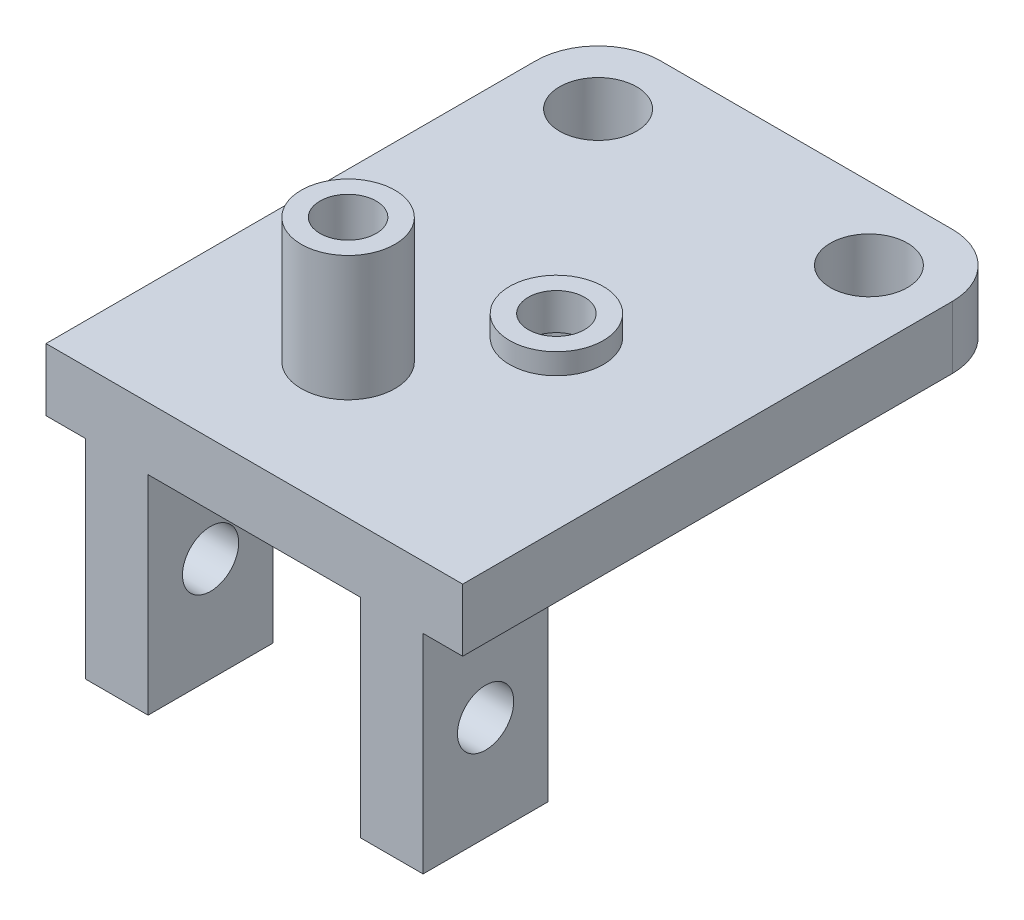
ISO-10303-21;
HEADER;
FILE_DESCRIPTION(('STEP AP214'),'2;1');
FILE_NAME('part.step','',(''),(''),'','','');
FILE_SCHEMA(('AUTOMOTIVE_DESIGN { 1 0 10303 214 1 1 1 1 }'));
ENDSEC;
DATA;
#1=APPLICATION_CONTEXT('core data for automotive mechanical design processes');
#2=APPLICATION_PROTOCOL_DEFINITION('international standard','automotive_design',2000,#1);
#3=PRODUCT_CONTEXT('',#1,'mechanical');
#4=PRODUCT('Part','Part','',(#3));
#5=PRODUCT_RELATED_PRODUCT_CATEGORY('part','',(#4));
#6=PRODUCT_DEFINITION_FORMATION('','',#4);
#7=PRODUCT_DEFINITION_CONTEXT('part definition',#1,'design');
#8=PRODUCT_DEFINITION('design','',#6,#7);
#9=PRODUCT_DEFINITION_SHAPE('','',#8);
#10=(LENGTH_UNIT() NAMED_UNIT(*) SI_UNIT(.MILLI.,.METRE.));
#11=(NAMED_UNIT(*) PLANE_ANGLE_UNIT() SI_UNIT($,.RADIAN.));
#12=(NAMED_UNIT(*) SI_UNIT($,.STERADIAN.) SOLID_ANGLE_UNIT());
#13=UNCERTAINTY_MEASURE_WITH_UNIT(LENGTH_MEASURE(1.E-05),#10,'distance_accuracy_value','');
#14=(GEOMETRIC_REPRESENTATION_CONTEXT(3) GLOBAL_UNCERTAINTY_ASSIGNED_CONTEXT((#13)) GLOBAL_UNIT_ASSIGNED_CONTEXT((#10,
#11,#12)) REPRESENTATION_CONTEXT('',''));
#15=CARTESIAN_POINT('',(0.,0.,0.));
#16=DIRECTION('',(0.,0.,1.));
#17=DIRECTION('',(1.,0.,0.));
#18=AXIS2_PLACEMENT_3D('',#15,#16,#17);
#19=CARTESIAN_POINT('',(0.,0.,0.));
#20=DIRECTION('',(1.,0.,0.));
#21=DIRECTION('',(0.,0.,-1.));
#22=AXIS2_PLACEMENT_3D('',#19,#20,#21);
#23=PLANE('',#22);
#24=DIRECTION('',(0.,0.,1.));
#25=VECTOR('',#24,1.);
#26=CARTESIAN_POINT('',(0.,0.,0.));
#27=LINE('',#26,#25);
#28=CARTESIAN_POINT('',(0.,0.,-47.));
#29=VERTEX_POINT('',#28);
#30=CARTESIAN_POINT('',(0.,0.,0.));
#31=VERTEX_POINT('',#30);
#32=EDGE_CURVE('E245',#29,#31,#27,.T.);
#33=ORIENTED_EDGE('',*,*,#32,.F.);
#34=DIRECTION('',(0.,-1.,0.));
#35=VECTOR('',#34,1.);
#36=CARTESIAN_POINT('',(0.,0.,-47.));
#37=LINE('',#36,#35);
#38=CARTESIAN_POINT('',(0.,6.,-47.));
#39=VERTEX_POINT('',#38);
#40=EDGE_CURVE('E234',#39,#29,#37,.T.);
#41=ORIENTED_EDGE('',*,*,#40,.F.);
#42=DIRECTION('',(0.,0.,1.));
#43=VECTOR('',#42,1.);
#44=CARTESIAN_POINT('',(0.,6.,0.));
#45=LINE('',#44,#43);
#46=CARTESIAN_POINT('',(0.,6.,0.));
#47=VERTEX_POINT('',#46);
#48=EDGE_CURVE('E227',#39,#47,#45,.T.);
#49=ORIENTED_EDGE('',*,*,#48,.T.);
#50=DIRECTION('',(0.,-1.,0.));
#51=VECTOR('',#50,1.);
#52=CARTESIAN_POINT('',(0.,6.,0.));
#53=LINE('',#52,#51);
#54=EDGE_CURVE('E236',#47,#31,#53,.T.);
#55=ORIENTED_EDGE('',*,*,#54,.T.);
#56=EDGE_LOOP('',(#33,#41,#49,#55));
#57=FACE_BOUND('',#56,.T.);
#58=ADVANCED_FACE('F40',(#57),#23,.T.);
#59=CARTESIAN_POINT('',(-24.,0.,-13.));
#60=DIRECTION('',(0.,-1.,0.));
#61=DIRECTION('',(0.,0.,-1.));
#62=AXIS2_PLACEMENT_3D('',#59,#60,#61);
#63=CYLINDRICAL_SURFACE('',#62,2.69999999999999);
#64=CARTESIAN_POINT('',(-24.,4.5,-13.));
#65=DIRECTION('',(0.,-1.,0.));
#66=DIRECTION('',(0.,0.,-1.));
#67=AXIS2_PLACEMENT_3D('',#64,#65,#66);
#68=CIRCLE('',#67,2.69999999999999);
#69=CARTESIAN_POINT('',(-24.,4.5,-15.7));
#70=VERTEX_POINT('',#69);
#71=EDGE_CURVE('E363',#70,#70,#68,.T.);
#72=ORIENTED_EDGE('',*,*,#71,.T.);
#73=EDGE_LOOP('',(#72));
#74=FACE_BOUND('',#73,.T.);
#75=CARTESIAN_POINT('',(-24.,18.,-13.));
#76=DIRECTION('',(0.,-1.,0.));
#77=DIRECTION('',(0.,0.,-1.));
#78=AXIS2_PLACEMENT_3D('',#75,#76,#77);
#79=CIRCLE('',#78,2.7);
#80=CARTESIAN_POINT('',(-24.,18.,-15.7));
#81=VERTEX_POINT('',#80);
#82=EDGE_CURVE('E359',#81,#81,#79,.T.);
#83=ORIENTED_EDGE('',*,*,#82,.F.);
#84=EDGE_LOOP('',(#83));
#85=FACE_BOUND('',#84,.T.);
#86=ADVANCED_FACE('F600',(#74,#85),#63,.F.);
#87=CARTESIAN_POINT('',(-16.,0.,-25.));
#88=DIRECTION('',(0.,-1.,0.));
#89=DIRECTION('',(0.,0.,-1.));
#90=AXIS2_PLACEMENT_3D('',#87,#88,#89);
#91=CYLINDRICAL_SURFACE('',#90,2.69999999999999);
#92=CARTESIAN_POINT('',(-16.,8.,-25.));
#93=DIRECTION('',(0.,1.,0.));
#94=DIRECTION('',(0.,0.,1.));
#95=AXIS2_PLACEMENT_3D('',#92,#93,#94);
#96=CIRCLE('',#95,2.69999999999999);
#97=CARTESIAN_POINT('',(-16.,8.,-22.3));
#98=VERTEX_POINT('',#97);
#99=EDGE_CURVE('E355',#98,#98,#96,.T.);
#100=ORIENTED_EDGE('',*,*,#99,.T.);
#101=EDGE_LOOP('',(#100));
#102=FACE_BOUND('',#101,.T.);
#103=CARTESIAN_POINT('',(-16.,4.5,-25.));
#104=DIRECTION('',(0.,-1.,0.));
#105=DIRECTION('',(0.,0.,-1.));
#106=AXIS2_PLACEMENT_3D('',#103,#104,#105);
#107=CIRCLE('',#106,2.69999999999999);
#108=CARTESIAN_POINT('',(-16.,4.5,-27.7));
#109=VERTEX_POINT('',#108);
#110=EDGE_CURVE('E354',#109,#109,#107,.T.);
#111=ORIENTED_EDGE('',*,*,#110,.T.);
#112=EDGE_LOOP('',(#111));
#113=FACE_BOUND('',#112,.T.);
#114=ADVANCED_FACE('F602',(#102,#113),#91,.F.);
#115=CARTESIAN_POINT('',(0.,4.5,0.));
#116=DIRECTION('',(0.,-1.,0.));
#117=DIRECTION('',(0.,0.,-1.));
#118=AXIS2_PLACEMENT_3D('',#115,#116,#117);
#119=PLANE('',#118);
#120=ORIENTED_EDGE('',*,*,#110,.F.);
#121=EDGE_LOOP('',(#120));
#122=FACE_BOUND('',#121,.T.);
#123=DIRECTION('',(0.866025403784439,0.,0.5));
#124=VECTOR('',#123,1.);
#125=CARTESIAN_POINT('',(-20.2,4.5,-22.5751288694036));
#126=LINE('',#125,#124);
#127=CARTESIAN_POINT('',(-20.2,4.5,-22.5751288694036));
#128=VERTEX_POINT('',#127);
#129=CARTESIAN_POINT('',(-16.,4.5,-20.1502577388071));
#130=VERTEX_POINT('',#129);
#131=EDGE_CURVE('E429',#128,#130,#126,.T.);
#132=ORIENTED_EDGE('',*,*,#131,.F.);
#133=DIRECTION('',(0.,0.,1.));
#134=VECTOR('',#133,1.);
#135=CARTESIAN_POINT('',(-20.2,4.5,-27.4248711305964));
#136=LINE('',#135,#134);
#137=CARTESIAN_POINT('',(-20.2,4.5,-27.4248711305964));
#138=VERTEX_POINT('',#137);
#139=EDGE_CURVE('E434',#138,#128,#136,.T.);
#140=ORIENTED_EDGE('',*,*,#139,.F.);
#141=DIRECTION('',(-0.866025403784439,0.,0.5));
#142=VECTOR('',#141,1.);
#143=CARTESIAN_POINT('',(-16.,4.5,-29.8497422611929));
#144=LINE('',#143,#142);
#145=CARTESIAN_POINT('',(-16.,4.5,-29.8497422611929));
#146=VERTEX_POINT('',#145);
#147=EDGE_CURVE('E437',#146,#138,#144,.T.);
#148=ORIENTED_EDGE('',*,*,#147,.F.);
#149=DIRECTION('',(-0.866025403784438,0.,-0.5));
#150=VECTOR('',#149,1.);
#151=CARTESIAN_POINT('',(-11.8,4.5,-27.4248711305964));
#152=LINE('',#151,#150);
#153=CARTESIAN_POINT('',(-11.8,4.5,-27.4248711305964));
#154=VERTEX_POINT('',#153);
#155=EDGE_CURVE('E440',#154,#146,#152,.T.);
#156=ORIENTED_EDGE('',*,*,#155,.F.);
#157=DIRECTION('',(0.,0.,-1.));
#158=VECTOR('',#157,1.);
#159=CARTESIAN_POINT('',(-11.8,4.5,-22.5751288694036));
#160=LINE('',#159,#158);
#161=CARTESIAN_POINT('',(-11.8,4.5,-22.5751288694036));
#162=VERTEX_POINT('',#161);
#163=EDGE_CURVE('E443',#162,#154,#160,.T.);
#164=ORIENTED_EDGE('',*,*,#163,.F.);
#165=DIRECTION('',(0.866025403784439,0.,-0.5));
#166=VECTOR('',#165,1.);
#167=CARTESIAN_POINT('',(-16.,4.5,-20.1502577388071));
#168=LINE('',#167,#166);
#169=EDGE_CURVE('E446',#130,#162,#168,.T.);
#170=ORIENTED_EDGE('',*,*,#169,.F.);
#171=EDGE_LOOP('',(#132,#140,#148,#156,#164,#170));
#172=FACE_BOUND('',#171,.T.);
#173=ADVANCED_FACE('F609',(#122,#172),#119,.T.);
#174=CARTESIAN_POINT('',(0.,4.5,0.));
#175=DIRECTION('',(0.,-1.,0.));
#176=DIRECTION('',(0.,0.,-1.));
#177=AXIS2_PLACEMENT_3D('',#174,#175,#176);
#178=PLANE('',#177);
#179=ORIENTED_EDGE('',*,*,#71,.F.);
#180=EDGE_LOOP('',(#179));
#181=FACE_BOUND('',#180,.T.);
#182=DIRECTION('',(0.,0.,1.));
#183=VECTOR('',#182,1.);
#184=CARTESIAN_POINT('',(-28.2,4.5,-15.4248711305964));
#185=LINE('',#184,#183);
#186=CARTESIAN_POINT('',(-28.2,4.5,-15.4248711305964));
#187=VERTEX_POINT('',#186);
#188=CARTESIAN_POINT('',(-28.2,4.5,-10.5751288694036));
#189=VERTEX_POINT('',#188);
#190=EDGE_CURVE('E364',#187,#189,#185,.T.);
#191=ORIENTED_EDGE('',*,*,#190,.F.);
#192=DIRECTION('',(-0.866025403784439,0.,0.5));
#193=VECTOR('',#192,1.);
#194=CARTESIAN_POINT('',(-24.,4.5,-17.8497422611929));
#195=LINE('',#194,#193);
#196=CARTESIAN_POINT('',(-24.,4.5,-17.8497422611929));
#197=VERTEX_POINT('',#196);
#198=EDGE_CURVE('E369',#197,#187,#195,.T.);
#199=ORIENTED_EDGE('',*,*,#198,.F.);
#200=DIRECTION('',(-0.866025403784438,0.,-0.500000000000001));
#201=VECTOR('',#200,1.);
#202=CARTESIAN_POINT('',(-19.8,4.5,-15.4248711305964));
#203=LINE('',#202,#201);
#204=CARTESIAN_POINT('',(-19.8,4.5,-15.4248711305964));
#205=VERTEX_POINT('',#204);
#206=EDGE_CURVE('E372',#205,#197,#203,.T.);
#207=ORIENTED_EDGE('',*,*,#206,.F.);
#208=DIRECTION('',(0.,0.,-1.));
#209=VECTOR('',#208,1.);
#210=CARTESIAN_POINT('',(-19.8,4.5,-10.5751288694036));
#211=LINE('',#210,#209);
#212=CARTESIAN_POINT('',(-19.8,4.5,-10.5751288694036));
#213=VERTEX_POINT('',#212);
#214=EDGE_CURVE('E375',#213,#205,#211,.T.);
#215=ORIENTED_EDGE('',*,*,#214,.F.);
#216=DIRECTION('',(0.866025403784438,0.,-0.5));
#217=VECTOR('',#216,1.);
#218=CARTESIAN_POINT('',(-24.,4.5,-8.15025773880714));
#219=LINE('',#218,#217);
#220=CARTESIAN_POINT('',(-24.,4.5,-8.15025773880714));
#221=VERTEX_POINT('',#220);
#222=EDGE_CURVE('E378',#221,#213,#219,.T.);
#223=ORIENTED_EDGE('',*,*,#222,.F.);
#224=DIRECTION('',(0.866025403784438,0.,0.500000000000001));
#225=VECTOR('',#224,1.);
#226=CARTESIAN_POINT('',(-28.2,4.5,-10.5751288694036));
#227=LINE('',#226,#225);
#228=EDGE_CURVE('E381',#189,#221,#227,.T.);
#229=ORIENTED_EDGE('',*,*,#228,.F.);
#230=EDGE_LOOP('',(#191,#199,#207,#215,#223,#229));
#231=FACE_BOUND('',#230,.T.);
#232=ADVANCED_FACE('F615',(#181,#231),#178,.T.);
#233=CARTESIAN_POINT('',(-9.8,-10.,-6.));
#234=DIRECTION('',(-1.,0.,0.));
#235=DIRECTION('',(0.,0.,1.));
#236=AXIS2_PLACEMENT_3D('',#233,#234,#235);
#237=CYLINDRICAL_SURFACE('',#236,2.69999999999999);
#238=CARTESIAN_POINT('',(-3.8,-10.,-6.));
#239=DIRECTION('',(1.,0.,0.));
#240=DIRECTION('',(0.,0.,-1.));
#241=AXIS2_PLACEMENT_3D('',#238,#239,#240);
#242=CIRCLE('',#241,2.69999999999999);
#243=CARTESIAN_POINT('',(-3.8,-10.,-8.69999999999999));
#244=VERTEX_POINT('',#243);
#245=EDGE_CURVE('E301',#244,#244,#242,.T.);
#246=ORIENTED_EDGE('',*,*,#245,.T.);
#247=EDGE_LOOP('',(#246));
#248=FACE_BOUND('',#247,.T.);
#249=CARTESIAN_POINT('',(-9.8,-10.,-6.));
#250=DIRECTION('',(-1.,0.,0.));
#251=DIRECTION('',(0.,0.,1.));
#252=AXIS2_PLACEMENT_3D('',#249,#250,#251);
#253=CIRCLE('',#252,2.69999999999999);
#254=CARTESIAN_POINT('',(-9.8,-10.,-3.30000000000001));
#255=VERTEX_POINT('',#254);
#256=EDGE_CURVE('E297',#255,#255,#253,.T.);
#257=ORIENTED_EDGE('',*,*,#256,.T.);
#258=EDGE_LOOP('',(#257));
#259=FACE_BOUND('',#258,.T.);
#260=ADVANCED_FACE('F637',(#248,#259),#237,.F.);
#261=CARTESIAN_POINT('',(-30.2,-10.,-6.));
#262=DIRECTION('',(1.,0.,0.));
#263=DIRECTION('',(0.,0.,-1.));
#264=AXIS2_PLACEMENT_3D('',#261,#262,#263);
#265=CYLINDRICAL_SURFACE('',#264,2.69999999999999);
#266=CARTESIAN_POINT('',(-30.2,-10.,-6.));
#267=DIRECTION('',(1.,0.,0.));
#268=DIRECTION('',(0.,0.,-1.));
#269=AXIS2_PLACEMENT_3D('',#266,#267,#268);
#270=CIRCLE('',#269,2.69999999999999);
#271=CARTESIAN_POINT('',(-30.2,-10.,-8.69999999999999));
#272=VERTEX_POINT('',#271);
#273=EDGE_CURVE('E12',#272,#272,#270,.T.);
#274=ORIENTED_EDGE('',*,*,#273,.T.);
#275=EDGE_LOOP('',(#274));
#276=FACE_BOUND('',#275,.T.);
#277=CARTESIAN_POINT('',(-36.2,-10.,-6.));
#278=DIRECTION('',(1.,0.,0.));
#279=DIRECTION('',(0.,0.,-1.));
#280=AXIS2_PLACEMENT_3D('',#277,#278,#279);
#281=CIRCLE('',#280,2.69999999999999);
#282=CARTESIAN_POINT('',(-36.2,-10.,-8.69999999999999));
#283=VERTEX_POINT('',#282);
#284=EDGE_CURVE('E51',#283,#283,#281,.T.);
#285=ORIENTED_EDGE('',*,*,#284,.F.);
#286=EDGE_LOOP('',(#285));
#287=FACE_BOUND('',#286,.T.);
#288=ADVANCED_FACE('F639',(#276,#287),#265,.F.);
#289=CARTESIAN_POINT('',(-24.,18.,-13.));
#290=DIRECTION('',(0.,1.,0.));
#291=DIRECTION('',(0.,0.,1.));
#292=AXIS2_PLACEMENT_3D('',#289,#290,#291);
#293=PLANE('',#292);
#294=ORIENTED_EDGE('',*,*,#82,.T.);
#295=EDGE_LOOP('',(#294));
#296=FACE_BOUND('',#295,.T.);
#297=CARTESIAN_POINT('',(-24.,18.,-13.));
#298=DIRECTION('',(0.,-1.,0.));
#299=DIRECTION('',(0.,0.,1.));
#300=AXIS2_PLACEMENT_3D('',#297,#298,#299);
#301=CIRCLE('',#300,4.5);
#302=CARTESIAN_POINT('',(-24.,18.,-8.5));
#303=VERTEX_POINT('',#302);
#304=EDGE_CURVE('E491',#303,#303,#301,.T.);
#305=ORIENTED_EDGE('',*,*,#304,.F.);
#306=EDGE_LOOP('',(#305));
#307=FACE_BOUND('',#306,.T.);
#308=ADVANCED_FACE('F656',(#296,#307),#293,.T.);
#309=CARTESIAN_POINT('',(-16.,8.,-25.));
#310=DIRECTION('',(0.,1.,0.));
#311=DIRECTION('',(0.,0.,1.));
#312=AXIS2_PLACEMENT_3D('',#309,#310,#311);
#313=PLANE('',#312);
#314=ORIENTED_EDGE('',*,*,#99,.F.);
#315=EDGE_LOOP('',(#314));
#316=FACE_BOUND('',#315,.T.);
#317=CARTESIAN_POINT('',(-16.,8.,-25.));
#318=DIRECTION('',(0.,-1.,0.));
#319=DIRECTION('',(0.,0.,1.));
#320=AXIS2_PLACEMENT_3D('',#317,#318,#319);
#321=CIRCLE('',#320,4.5);
#322=CARTESIAN_POINT('',(-16.,8.,-20.5));
#323=VERTEX_POINT('',#322);
#324=EDGE_CURVE('E499',#323,#323,#321,.T.);
#325=ORIENTED_EDGE('',*,*,#324,.F.);
#326=EDGE_LOOP('',(#325));
#327=FACE_BOUND('',#326,.T.);
#328=ADVANCED_FACE('F652',(#316,#327),#313,.T.);
#329=CARTESIAN_POINT('',(-30.2,-20.,-12.));
#330=DIRECTION('',(0.,0.,1.));
#331=DIRECTION('',(1.,0.,0.));
#332=AXIS2_PLACEMENT_3D('',#329,#330,#331);
#333=PLANE('',#332);
#334=DIRECTION('',(1.,0.,0.));
#335=VECTOR('',#334,1.);
#336=CARTESIAN_POINT('',(-30.2,0.,-12.));
#337=LINE('',#336,#335);
#338=CARTESIAN_POINT('',(-36.2,0.,-12.));
#339=VERTEX_POINT('',#338);
#340=CARTESIAN_POINT('',(-30.2,0.,-12.));
#341=VERTEX_POINT('',#340);
#342=EDGE_CURVE('E85',#339,#341,#337,.T.);
#343=ORIENTED_EDGE('',*,*,#342,.T.);
#344=DIRECTION('',(0.,1.,0.));
#345=VECTOR('',#344,1.);
#346=CARTESIAN_POINT('',(-30.2,-20.,-12.));
#347=LINE('',#346,#345);
#348=CARTESIAN_POINT('',(-30.2,-20.,-12.));
#349=VERTEX_POINT('',#348);
#350=EDGE_CURVE('E271',#349,#341,#347,.T.);
#351=ORIENTED_EDGE('',*,*,#350,.F.);
#352=DIRECTION('',(1.,0.,0.));
#353=VECTOR('',#352,1.);
#354=CARTESIAN_POINT('',(-30.2,-20.,-12.));
#355=LINE('',#354,#353);
#356=CARTESIAN_POINT('',(-36.2,-20.,-12.));
#357=VERTEX_POINT('',#356);
#358=EDGE_CURVE('E268',#357,#349,#355,.T.);
#359=ORIENTED_EDGE('',*,*,#358,.F.);
#360=DIRECTION('',(0.,1.,0.));
#361=VECTOR('',#360,1.);
#362=CARTESIAN_POINT('',(-36.2,-20.,-12.));
#363=LINE('',#362,#361);
#364=EDGE_CURVE('E281',#357,#339,#363,.T.);
#365=ORIENTED_EDGE('',*,*,#364,.T.);
#366=EDGE_LOOP('',(#343,#351,#359,#365));
#367=FACE_BOUND('',#366,.T.);
#368=ADVANCED_FACE('F629',(#367),#333,.F.);
#369=CARTESIAN_POINT('',(-9.8,-20.,-12.));
#370=DIRECTION('',(0.,0.,-1.));
#371=DIRECTION('',(-1.,0.,0.));
#372=AXIS2_PLACEMENT_3D('',#369,#370,#371);
#373=PLANE('',#372);
#374=DIRECTION('',(-1.,0.,0.));
#375=VECTOR('',#374,1.);
#376=CARTESIAN_POINT('',(-9.8,0.,-12.));
#377=LINE('',#376,#375);
#378=CARTESIAN_POINT('',(-3.8,0.,-12.));
#379=VERTEX_POINT('',#378);
#380=CARTESIAN_POINT('',(-9.8,0.,-12.));
#381=VERTEX_POINT('',#380);
#382=EDGE_CURVE('E327',#379,#381,#377,.T.);
#383=ORIENTED_EDGE('',*,*,#382,.F.);
#384=DIRECTION('',(0.,1.,0.));
#385=VECTOR('',#384,1.);
#386=CARTESIAN_POINT('',(-3.8,-20.,-12.));
#387=LINE('',#386,#385);
#388=CARTESIAN_POINT('',(-3.8,-20.,-12.));
#389=VERTEX_POINT('',#388);
#390=EDGE_CURVE('E340',#389,#379,#387,.T.);
#391=ORIENTED_EDGE('',*,*,#390,.F.);
#392=DIRECTION('',(-1.,0.,0.));
#393=VECTOR('',#392,1.);
#394=CARTESIAN_POINT('',(-9.8,-20.,-12.));
#395=LINE('',#394,#393);
#396=CARTESIAN_POINT('',(-9.8,-20.,-12.));
#397=VERTEX_POINT('',#396);
#398=EDGE_CURVE('E311',#389,#397,#395,.T.);
#399=ORIENTED_EDGE('',*,*,#398,.T.);
#400=DIRECTION('',(0.,1.,0.));
#401=VECTOR('',#400,1.);
#402=CARTESIAN_POINT('',(-9.8,-20.,-12.));
#403=LINE('',#402,#401);
#404=EDGE_CURVE('E343',#397,#381,#403,.T.);
#405=ORIENTED_EDGE('',*,*,#404,.T.);
#406=EDGE_LOOP('',(#383,#391,#399,#405));
#407=FACE_BOUND('',#406,.T.);
#408=ADVANCED_FACE('F574',(#407),#373,.T.);
#409=CARTESIAN_POINT('',(-16.,4.5,-29.8497422611929));
#410=DIRECTION('',(0.5,0.,0.866025403784438));
#411=DIRECTION('',(0.866025403784439,0.,-0.5));
#412=AXIS2_PLACEMENT_3D('',#409,#410,#411);
#413=PLANE('',#412);
#414=DIRECTION('',(-0.866025403784439,0.,0.5));
#415=VECTOR('',#414,1.);
#416=CARTESIAN_POINT('',(-16.,0.,-29.8497422611929));
#417=LINE('',#416,#415);
#418=CARTESIAN_POINT('',(-16.,0.,-29.8497422611929));
#419=VERTEX_POINT('',#418);
#420=CARTESIAN_POINT('',(-20.2,0.,-27.4248711305964));
#421=VERTEX_POINT('',#420);
#422=EDGE_CURVE('E458',#419,#421,#417,.T.);
#423=ORIENTED_EDGE('',*,*,#422,.F.);
#424=DIRECTION('',(0.,-1.,0.));
#425=VECTOR('',#424,1.);
#426=CARTESIAN_POINT('',(-16.,4.5,-29.8497422611929));
#427=LINE('',#426,#425);
#428=EDGE_CURVE('E482',#146,#419,#427,.T.);
#429=ORIENTED_EDGE('',*,*,#428,.F.);
#430=ORIENTED_EDGE('',*,*,#147,.T.);
#431=DIRECTION('',(0.,-1.,0.));
#432=VECTOR('',#431,1.);
#433=CARTESIAN_POINT('',(-20.2,4.5,-27.4248711305964));
#434=LINE('',#433,#432);
#435=EDGE_CURVE('E485',#138,#421,#434,.T.);
#436=ORIENTED_EDGE('',*,*,#435,.T.);
#437=EDGE_LOOP('',(#423,#429,#430,#436));
#438=FACE_BOUND('',#437,.T.);
#439=ADVANCED_FACE('F628',(#438),#413,.T.);
#440=CARTESIAN_POINT('',(-11.8,4.5,-27.4248711305964));
#441=DIRECTION('',(-0.5,0.,0.866025403784438));
#442=DIRECTION('',(0.866025403784438,0.,0.5));
#443=AXIS2_PLACEMENT_3D('',#440,#441,#442);
#444=PLANE('',#443);
#445=DIRECTION('',(-0.866025403784438,0.,-0.5));
#446=VECTOR('',#445,1.);
#447=CARTESIAN_POINT('',(-11.8,0.,-27.4248711305964));
#448=LINE('',#447,#446);
#449=CARTESIAN_POINT('',(-11.8,0.,-27.4248711305964));
#450=VERTEX_POINT('',#449);
#451=EDGE_CURVE('E462',#450,#419,#448,.T.);
#452=ORIENTED_EDGE('',*,*,#451,.F.);
#453=DIRECTION('',(0.,-1.,0.));
#454=VECTOR('',#453,1.);
#455=CARTESIAN_POINT('',(-11.8,4.5,-27.4248711305964));
#456=LINE('',#455,#454);
#457=EDGE_CURVE('E479',#154,#450,#456,.T.);
#458=ORIENTED_EDGE('',*,*,#457,.F.);
#459=ORIENTED_EDGE('',*,*,#155,.T.);
#460=ORIENTED_EDGE('',*,*,#428,.T.);
#461=EDGE_LOOP('',(#452,#458,#459,#460));
#462=FACE_BOUND('',#461,.T.);
#463=ADVANCED_FACE('F823',(#462),#444,.T.);
#464=CARTESIAN_POINT('',(-11.8,4.5,-22.5751288694036));
#465=DIRECTION('',(-1.,0.,0.));
#466=DIRECTION('',(0.,0.,1.));
#467=AXIS2_PLACEMENT_3D('',#464,#465,#466);
#468=PLANE('',#467);
#469=DIRECTION('',(0.,0.,-1.));
#470=VECTOR('',#469,1.);
#471=CARTESIAN_POINT('',(-11.8,0.,-22.5751288694036));
#472=LINE('',#471,#470);
#473=CARTESIAN_POINT('',(-11.8,0.,-22.5751288694036));
#474=VERTEX_POINT('',#473);
#475=EDGE_CURVE('E466',#474,#450,#472,.T.);
#476=ORIENTED_EDGE('',*,*,#475,.F.);
#477=DIRECTION('',(0.,-1.,0.));
#478=VECTOR('',#477,1.);
#479=CARTESIAN_POINT('',(-11.8,4.5,-22.5751288694036));
#480=LINE('',#479,#478);
#481=EDGE_CURVE('E476',#162,#474,#480,.T.);
#482=ORIENTED_EDGE('',*,*,#481,.F.);
#483=ORIENTED_EDGE('',*,*,#163,.T.);
#484=ORIENTED_EDGE('',*,*,#457,.T.);
#485=EDGE_LOOP('',(#476,#482,#483,#484));
#486=FACE_BOUND('',#485,.T.);
#487=ADVANCED_FACE('F833',(#486),#468,.T.);
#488=CARTESIAN_POINT('',(-16.,4.5,-20.1502577388071));
#489=DIRECTION('',(-0.5,0.,-0.866025403784439));
#490=DIRECTION('',(-0.866025403784439,0.,0.5));
#491=AXIS2_PLACEMENT_3D('',#488,#489,#490);
#492=PLANE('',#491);
#493=DIRECTION('',(0.866025403784439,0.,-0.5));
#494=VECTOR('',#493,1.);
#495=CARTESIAN_POINT('',(-16.,0.,-20.1502577388071));
#496=LINE('',#495,#494);
#497=CARTESIAN_POINT('',(-16.,0.,-20.1502577388071));
#498=VERTEX_POINT('',#497);
#499=EDGE_CURVE('E433',#498,#474,#496,.T.);
#500=ORIENTED_EDGE('',*,*,#499,.F.);
#501=DIRECTION('',(0.,-1.,0.));
#502=VECTOR('',#501,1.);
#503=CARTESIAN_POINT('',(-16.,4.5,-20.1502577388071));
#504=LINE('',#503,#502);
#505=EDGE_CURVE('E389',#130,#498,#504,.T.);
#506=ORIENTED_EDGE('',*,*,#505,.F.);
#507=ORIENTED_EDGE('',*,*,#169,.T.);
#508=ORIENTED_EDGE('',*,*,#481,.T.);
#509=EDGE_LOOP('',(#500,#506,#507,#508));
#510=FACE_BOUND('',#509,.T.);
#511=ADVANCED_FACE('F843',(#510),#492,.T.);
#512=CARTESIAN_POINT('',(-20.2,4.5,-22.5751288694036));
#513=DIRECTION('',(0.5,0.,-0.866025403784439));
#514=DIRECTION('',(-0.866025403784439,0.,-0.5));
#515=AXIS2_PLACEMENT_3D('',#512,#513,#514);
#516=PLANE('',#515);
#517=DIRECTION('',(0.866025403784439,0.,0.5));
#518=VECTOR('',#517,1.);
#519=CARTESIAN_POINT('',(-20.2,0.,-22.5751288694036));
#520=LINE('',#519,#518);
#521=CARTESIAN_POINT('',(-20.2,0.,-22.5751288694036));
#522=VERTEX_POINT('',#521);
#523=EDGE_CURVE('E450',#522,#498,#520,.T.);
#524=ORIENTED_EDGE('',*,*,#523,.F.);
#525=DIRECTION('',(0.,-1.,0.));
#526=VECTOR('',#525,1.);
#527=CARTESIAN_POINT('',(-20.2,4.5,-22.5751288694036));
#528=LINE('',#527,#526);
#529=EDGE_CURVE('E449',#128,#522,#528,.T.);
#530=ORIENTED_EDGE('',*,*,#529,.F.);
#531=ORIENTED_EDGE('',*,*,#131,.T.);
#532=ORIENTED_EDGE('',*,*,#505,.T.);
#533=EDGE_LOOP('',(#524,#530,#531,#532));
#534=FACE_BOUND('',#533,.T.);
#535=ADVANCED_FACE('F853',(#534),#516,.T.);
#536=CARTESIAN_POINT('',(-20.2,4.5,-27.4248711305964));
#537=DIRECTION('',(1.,0.,0.));
#538=DIRECTION('',(0.,0.,-1.));
#539=AXIS2_PLACEMENT_3D('',#536,#537,#538);
#540=PLANE('',#539);
#541=DIRECTION('',(0.,0.,1.));
#542=VECTOR('',#541,1.);
#543=CARTESIAN_POINT('',(-20.2,0.,-27.4248711305964));
#544=LINE('',#543,#542);
#545=EDGE_CURVE('E454',#421,#522,#544,.T.);
#546=ORIENTED_EDGE('',*,*,#545,.F.);
#547=ORIENTED_EDGE('',*,*,#435,.F.);
#548=ORIENTED_EDGE('',*,*,#139,.T.);
#549=ORIENTED_EDGE('',*,*,#529,.T.);
#550=EDGE_LOOP('',(#546,#547,#548,#549));
#551=FACE_BOUND('',#550,.T.);
#552=ADVANCED_FACE('F863',(#551),#540,.T.);
#553=CARTESIAN_POINT('',(-19.8,4.5,-15.4248711305964));
#554=DIRECTION('',(-0.500000000000001,0.,0.866025403784438));
#555=DIRECTION('',(0.866025403784438,0.,0.500000000000001));
#556=AXIS2_PLACEMENT_3D('',#553,#554,#555);
#557=PLANE('',#556);
#558=DIRECTION('',(-0.866025403784438,0.,-0.500000000000001));
#559=VECTOR('',#558,1.);
#560=CARTESIAN_POINT('',(-19.8,0.,-15.4248711305964));
#561=LINE('',#560,#559);
#562=CARTESIAN_POINT('',(-19.8,0.,-15.4248711305964));
#563=VERTEX_POINT('',#562);
#564=CARTESIAN_POINT('',(-24.,0.,-17.8497422611929));
#565=VERTEX_POINT('',#564);
#566=EDGE_CURVE('E394',#563,#565,#561,.T.);
#567=ORIENTED_EDGE('',*,*,#566,.F.);
#568=DIRECTION('',(0.,-1.,0.));
#569=VECTOR('',#568,1.);
#570=CARTESIAN_POINT('',(-19.8,4.5,-15.4248711305964));
#571=LINE('',#570,#569);
#572=EDGE_CURVE('E420',#205,#563,#571,.T.);
#573=ORIENTED_EDGE('',*,*,#572,.F.);
#574=ORIENTED_EDGE('',*,*,#206,.T.);
#575=DIRECTION('',(0.,-1.,0.));
#576=VECTOR('',#575,1.);
#577=CARTESIAN_POINT('',(-24.,4.5,-17.8497422611929));
#578=LINE('',#577,#576);
#579=EDGE_CURVE('E423',#197,#565,#578,.T.);
#580=ORIENTED_EDGE('',*,*,#579,.T.);
#581=EDGE_LOOP('',(#567,#573,#574,#580));
#582=FACE_BOUND('',#581,.T.);
#583=ADVANCED_FACE('F873',(#582),#557,.T.);
#584=CARTESIAN_POINT('',(-19.8,4.5,-10.5751288694036));
#585=DIRECTION('',(-1.,0.,0.));
#586=DIRECTION('',(0.,0.,1.));
#587=AXIS2_PLACEMENT_3D('',#584,#585,#586);
#588=PLANE('',#587);
#589=DIRECTION('',(0.,0.,-1.));
#590=VECTOR('',#589,1.);
#591=CARTESIAN_POINT('',(-19.8,0.,-10.5751288694036));
#592=LINE('',#591,#590);
#593=CARTESIAN_POINT('',(-19.8,0.,-10.5751288694036));
#594=VERTEX_POINT('',#593);
#595=EDGE_CURVE('E398',#594,#563,#592,.T.);
#596=ORIENTED_EDGE('',*,*,#595,.F.);
#597=DIRECTION('',(0.,-1.,0.));
#598=VECTOR('',#597,1.);
#599=CARTESIAN_POINT('',(-19.8,4.5,-10.5751288694036));
#600=LINE('',#599,#598);
#601=EDGE_CURVE('E417',#213,#594,#600,.T.);
#602=ORIENTED_EDGE('',*,*,#601,.F.);
#603=ORIENTED_EDGE('',*,*,#214,.T.);
#604=ORIENTED_EDGE('',*,*,#572,.T.);
#605=EDGE_LOOP('',(#596,#602,#603,#604));
#606=FACE_BOUND('',#605,.T.);
#607=ADVANCED_FACE('F883',(#606),#588,.T.);
#608=CARTESIAN_POINT('',(-24.,4.5,-8.15025773880714));
#609=DIRECTION('',(-0.5,0.,-0.866025403784438));
#610=DIRECTION('',(-0.866025403784438,0.,0.5));
#611=AXIS2_PLACEMENT_3D('',#608,#609,#610);
#612=PLANE('',#611);
#613=DIRECTION('',(0.866025403784438,0.,-0.5));
#614=VECTOR('',#613,1.);
#615=CARTESIAN_POINT('',(-24.,0.,-8.15025773880714));
#616=LINE('',#615,#614);
#617=CARTESIAN_POINT('',(-24.,0.,-8.15025773880714));
#618=VERTEX_POINT('',#617);
#619=EDGE_CURVE('E402',#618,#594,#616,.T.);
#620=ORIENTED_EDGE('',*,*,#619,.F.);
#621=DIRECTION('',(0.,-1.,0.));
#622=VECTOR('',#621,1.);
#623=CARTESIAN_POINT('',(-24.,4.5,-8.15025773880714));
#624=LINE('',#623,#622);
#625=EDGE_CURVE('E413',#221,#618,#624,.T.);
#626=ORIENTED_EDGE('',*,*,#625,.F.);
#627=ORIENTED_EDGE('',*,*,#222,.T.);
#628=ORIENTED_EDGE('',*,*,#601,.T.);
#629=EDGE_LOOP('',(#620,#626,#627,#628));
#630=FACE_BOUND('',#629,.T.);
#631=ADVANCED_FACE('F893',(#630),#612,.T.);
#632=CARTESIAN_POINT('',(-28.2,4.5,-10.5751288694036));
#633=DIRECTION('',(0.500000000000001,0.,-0.866025403784438));
#634=DIRECTION('',(-0.866025403784438,0.,-0.500000000000001));
#635=AXIS2_PLACEMENT_3D('',#632,#633,#634);
#636=PLANE('',#635);
#637=DIRECTION('',(0.866025403784438,0.,0.500000000000001));
#638=VECTOR('',#637,1.);
#639=CARTESIAN_POINT('',(-28.2,0.,-10.5751288694036));
#640=LINE('',#639,#638);
#641=CARTESIAN_POINT('',(-28.2,0.,-10.5751288694036));
#642=VERTEX_POINT('',#641);
#643=EDGE_CURVE('E368',#642,#618,#640,.T.);
#644=ORIENTED_EDGE('',*,*,#643,.F.);
#645=DIRECTION('',(0.,-1.,0.));
#646=VECTOR('',#645,1.);
#647=CARTESIAN_POINT('',(-28.2,4.5,-10.5751288694036));
#648=LINE('',#647,#646);
#649=EDGE_CURVE('E409',#189,#642,#648,.T.);
#650=ORIENTED_EDGE('',*,*,#649,.F.);
#651=ORIENTED_EDGE('',*,*,#228,.T.);
#652=ORIENTED_EDGE('',*,*,#625,.T.);
#653=EDGE_LOOP('',(#644,#650,#651,#652));
#654=FACE_BOUND('',#653,.T.);
#655=ADVANCED_FACE('F903',(#654),#636,.T.);
#656=CARTESIAN_POINT('',(-28.2,4.5,-15.4248711305964));
#657=DIRECTION('',(1.,0.,0.));
#658=DIRECTION('',(0.,0.,-1.));
#659=AXIS2_PLACEMENT_3D('',#656,#657,#658);
#660=PLANE('',#659);
#661=DIRECTION('',(0.,0.,1.));
#662=VECTOR('',#661,1.);
#663=CARTESIAN_POINT('',(-28.2,0.,-15.4248711305964));
#664=LINE('',#663,#662);
#665=CARTESIAN_POINT('',(-28.2,0.,-15.4248711305964));
#666=VERTEX_POINT('',#665);
#667=EDGE_CURVE('E385',#666,#642,#664,.T.);
#668=ORIENTED_EDGE('',*,*,#667,.F.);
#669=DIRECTION('',(0.,-1.,0.));
#670=VECTOR('',#669,1.);
#671=CARTESIAN_POINT('',(-28.2,4.5,-15.4248711305964));
#672=LINE('',#671,#670);
#673=EDGE_CURVE('E384',#187,#666,#672,.T.);
#674=ORIENTED_EDGE('',*,*,#673,.F.);
#675=ORIENTED_EDGE('',*,*,#190,.T.);
#676=ORIENTED_EDGE('',*,*,#649,.T.);
#677=EDGE_LOOP('',(#668,#674,#675,#676));
#678=FACE_BOUND('',#677,.T.);
#679=ADVANCED_FACE('F913',(#678),#660,.T.);
#680=CARTESIAN_POINT('',(-24.,4.5,-17.8497422611929));
#681=DIRECTION('',(0.5,0.,0.866025403784438));
#682=DIRECTION('',(0.866025403784439,0.,-0.5));
#683=AXIS2_PLACEMENT_3D('',#680,#681,#682);
#684=PLANE('',#683);
#685=DIRECTION('',(-0.866025403784439,0.,0.5));
#686=VECTOR('',#685,1.);
#687=CARTESIAN_POINT('',(-24.,0.,-17.8497422611929));
#688=LINE('',#687,#686);
#689=EDGE_CURVE('E390',#565,#666,#688,.T.);
#690=ORIENTED_EDGE('',*,*,#689,.F.);
#691=ORIENTED_EDGE('',*,*,#579,.F.);
#692=ORIENTED_EDGE('',*,*,#198,.T.);
#693=ORIENTED_EDGE('',*,*,#673,.T.);
#694=EDGE_LOOP('',(#690,#691,#692,#693));
#695=FACE_BOUND('',#694,.T.);
#696=ADVANCED_FACE('F633',(#695),#684,.T.);
#697=CARTESIAN_POINT('',(-3.8,-20.,0.));
#698=DIRECTION('',(1.,0.,0.));
#699=DIRECTION('',(0.,0.,-1.));
#700=AXIS2_PLACEMENT_3D('',#697,#698,#699);
#701=PLANE('',#700);
#702=ORIENTED_EDGE('',*,*,#245,.F.);
#703=EDGE_LOOP('',(#702));
#704=FACE_BOUND('',#703,.T.);
#705=DIRECTION('',(0.,0.,-1.));
#706=VECTOR('',#705,1.);
#707=CARTESIAN_POINT('',(-3.8,0.,0.));
#708=LINE('',#707,#706);
#709=CARTESIAN_POINT('',(-3.8,0.,0.));
#710=VERTEX_POINT('',#709);
#711=EDGE_CURVE('E310',#710,#379,#708,.T.);
#712=ORIENTED_EDGE('',*,*,#711,.F.);
#713=DIRECTION('',(0.,1.,0.));
#714=VECTOR('',#713,1.);
#715=CARTESIAN_POINT('',(-3.8,-20.,0.));
#716=LINE('',#715,#714);
#717=CARTESIAN_POINT('',(-3.8,-20.,0.));
#718=VERTEX_POINT('',#717);
#719=EDGE_CURVE('E337',#718,#710,#716,.T.);
#720=ORIENTED_EDGE('',*,*,#719,.F.);
#721=DIRECTION('',(0.,0.,-1.));
#722=VECTOR('',#721,1.);
#723=CARTESIAN_POINT('',(-3.8,-20.,0.));
#724=LINE('',#723,#722);
#725=EDGE_CURVE('E315',#718,#389,#724,.T.);
#726=ORIENTED_EDGE('',*,*,#725,.T.);
#727=ORIENTED_EDGE('',*,*,#390,.T.);
#728=EDGE_LOOP('',(#712,#720,#726,#727));
#729=FACE_BOUND('',#728,.T.);
#730=ADVANCED_FACE('F630',(#704,#729),#701,.T.);
#731=CARTESIAN_POINT('',(0.,-20.,0.));
#732=DIRECTION('',(0.,1.,0.));
#733=DIRECTION('',(0.,0.,1.));
#734=AXIS2_PLACEMENT_3D('',#731,#732,#733);
#735=PLANE('',#734);
#736=DIRECTION('',(0.,0.,1.));
#737=VECTOR('',#736,1.);
#738=CARTESIAN_POINT('',(-9.8,-20.,0.));
#739=LINE('',#738,#737);
#740=CARTESIAN_POINT('',(-9.8,-20.,0.));
#741=VERTEX_POINT('',#740);
#742=EDGE_CURVE('E306',#397,#741,#739,.T.);
#743=ORIENTED_EDGE('',*,*,#742,.F.);
#744=ORIENTED_EDGE('',*,*,#398,.F.);
#745=ORIENTED_EDGE('',*,*,#725,.F.);
#746=DIRECTION('',(1.,0.,0.));
#747=VECTOR('',#746,1.);
#748=CARTESIAN_POINT('',(-9.8,-20.,0.));
#749=LINE('',#748,#747);
#750=EDGE_CURVE('E319',#741,#718,#749,.T.);
#751=ORIENTED_EDGE('',*,*,#750,.F.);
#752=EDGE_LOOP('',(#743,#744,#745,#751));
#753=FACE_BOUND('',#752,.T.);
#754=ADVANCED_FACE('F577',(#753),#735,.F.);
#755=CARTESIAN_POINT('',(-9.8,-20.,0.));
#756=DIRECTION('',(-1.,0.,0.));
#757=DIRECTION('',(0.,0.,1.));
#758=AXIS2_PLACEMENT_3D('',#755,#756,#757);
#759=PLANE('',#758);
#760=ORIENTED_EDGE('',*,*,#256,.F.);
#761=EDGE_LOOP('',(#760));
#762=FACE_BOUND('',#761,.T.);
#763=DIRECTION('',(0.,0.,1.));
#764=VECTOR('',#763,1.);
#765=CARTESIAN_POINT('',(-9.8,0.,0.));
#766=LINE('',#765,#764);
#767=CARTESIAN_POINT('',(-9.8,0.,0.));
#768=VERTEX_POINT('',#767);
#769=EDGE_CURVE('E305',#381,#768,#766,.T.);
#770=ORIENTED_EDGE('',*,*,#769,.F.);
#771=ORIENTED_EDGE('',*,*,#404,.F.);
#772=ORIENTED_EDGE('',*,*,#742,.T.);
#773=DIRECTION('',(0.,1.,0.));
#774=VECTOR('',#773,1.);
#775=CARTESIAN_POINT('',(-9.8,-20.,0.));
#776=LINE('',#775,#774);
#777=EDGE_CURVE('E323',#741,#768,#776,.T.);
#778=ORIENTED_EDGE('',*,*,#777,.T.);
#779=EDGE_LOOP('',(#770,#771,#772,#778));
#780=FACE_BOUND('',#779,.T.);
#781=ADVANCED_FACE('F569',(#762,#780),#759,.T.);
#782=CARTESIAN_POINT('',(-30.2,-20.,0.));
#783=DIRECTION('',(-1.,0.,0.));
#784=DIRECTION('',(0.,0.,1.));
#785=AXIS2_PLACEMENT_3D('',#782,#783,#784);
#786=PLANE('',#785);
#787=ORIENTED_EDGE('',*,*,#273,.F.);
#788=EDGE_LOOP('',(#787));
#789=FACE_BOUND('',#788,.T.);
#790=DIRECTION('',(0.,0.,1.));
#791=VECTOR('',#790,1.);
#792=CARTESIAN_POINT('',(-30.2,0.,0.));
#793=LINE('',#792,#791);
#794=CARTESIAN_POINT('',(-30.2,0.,0.));
#795=VERTEX_POINT('',#794);
#796=EDGE_CURVE('E259',#341,#795,#793,.T.);
#797=ORIENTED_EDGE('',*,*,#796,.T.);
#798=DIRECTION('',(0.,1.,0.));
#799=VECTOR('',#798,1.);
#800=CARTESIAN_POINT('',(-30.2,-20.,0.));
#801=LINE('',#800,#799);
#802=CARTESIAN_POINT('',(-30.2,-20.,0.));
#803=VERTEX_POINT('',#802);
#804=EDGE_CURVE('E286',#803,#795,#801,.T.);
#805=ORIENTED_EDGE('',*,*,#804,.F.);
#806=DIRECTION('',(0.,0.,1.));
#807=VECTOR('',#806,1.);
#808=CARTESIAN_POINT('',(-30.2,-20.,0.));
#809=LINE('',#808,#807);
#810=EDGE_CURVE('E260',#349,#803,#809,.T.);
#811=ORIENTED_EDGE('',*,*,#810,.F.);
#812=ORIENTED_EDGE('',*,*,#350,.T.);
#813=EDGE_LOOP('',(#797,#805,#811,#812));
#814=FACE_BOUND('',#813,.T.);
#815=ADVANCED_FACE('F624',(#789,#814),#786,.F.);
#816=CARTESIAN_POINT('',(-40.,-20.,0.));
#817=DIRECTION('',(0.,1.,0.));
#818=DIRECTION('',(0.,0.,1.));
#819=AXIS2_PLACEMENT_3D('',#816,#817,#818);
#820=PLANE('',#819);
#821=ORIENTED_EDGE('',*,*,#810,.T.);
#822=DIRECTION('',(-1.,0.,0.));
#823=VECTOR('',#822,1.);
#824=CARTESIAN_POINT('',(-30.2,-20.,0.));
#825=LINE('',#824,#823);
#826=CARTESIAN_POINT('',(-36.2,-20.,0.));
#827=VERTEX_POINT('',#826);
#828=EDGE_CURVE('E77',#803,#827,#825,.T.);
#829=ORIENTED_EDGE('',*,*,#828,.T.);
#830=DIRECTION('',(0.,0.,-1.));
#831=VECTOR('',#830,1.);
#832=CARTESIAN_POINT('',(-36.2,-20.,0.));
#833=LINE('',#832,#831);
#834=EDGE_CURVE('E265',#827,#357,#833,.T.);
#835=ORIENTED_EDGE('',*,*,#834,.T.);
#836=ORIENTED_EDGE('',*,*,#358,.T.);
#837=EDGE_LOOP('',(#821,#829,#835,#836));
#838=FACE_BOUND('',#837,.T.);
#839=ADVANCED_FACE('F644',(#838),#820,.F.);
#840=CARTESIAN_POINT('',(-36.2,-20.,0.));
#841=DIRECTION('',(1.,0.,0.));
#842=DIRECTION('',(0.,0.,-1.));
#843=AXIS2_PLACEMENT_3D('',#840,#841,#842);
#844=PLANE('',#843);
#845=ORIENTED_EDGE('',*,*,#284,.T.);
#846=EDGE_LOOP('',(#845));
#847=FACE_BOUND('',#846,.T.);
#848=DIRECTION('',(0.,0.,-1.));
#849=VECTOR('',#848,1.);
#850=CARTESIAN_POINT('',(-36.2,0.,0.));
#851=LINE('',#850,#849);
#852=CARTESIAN_POINT('',(-36.2,0.,0.));
#853=VERTEX_POINT('',#852);
#854=EDGE_CURVE('E274',#853,#339,#851,.T.);
#855=ORIENTED_EDGE('',*,*,#854,.T.);
#856=ORIENTED_EDGE('',*,*,#364,.F.);
#857=ORIENTED_EDGE('',*,*,#834,.F.);
#858=DIRECTION('',(0.,1.,0.));
#859=VECTOR('',#858,1.);
#860=CARTESIAN_POINT('',(-36.2,-20.,0.));
#861=LINE('',#860,#859);
#862=EDGE_CURVE('E60',#827,#853,#861,.T.);
#863=ORIENTED_EDGE('',*,*,#862,.T.);
#864=EDGE_LOOP('',(#855,#856,#857,#863));
#865=FACE_BOUND('',#864,.T.);
#866=ADVANCED_FACE('F646',(#847,#865),#844,.F.);
#867=CARTESIAN_POINT('',(0.,6.,0.));
#868=DIRECTION('',(0.,0.,-1.));
#869=DIRECTION('',(-1.,0.,0.));
#870=AXIS2_PLACEMENT_3D('',#867,#868,#869);
#871=PLANE('',#870);
#872=ORIENTED_EDGE('',*,*,#54,.F.);
#873=DIRECTION('',(1.,0.,0.));
#874=VECTOR('',#873,1.);
#875=CARTESIAN_POINT('',(0.,6.,0.));
#876=LINE('',#875,#874);
#877=CARTESIAN_POINT('',(-40.,6.,0.));
#878=VERTEX_POINT('',#877);
#879=EDGE_CURVE('E224',#878,#47,#876,.T.);
#880=ORIENTED_EDGE('',*,*,#879,.F.);
#881=DIRECTION('',(0.,-1.,0.));
#882=VECTOR('',#881,1.);
#883=CARTESIAN_POINT('',(-40.,6.,0.));
#884=LINE('',#883,#882);
#885=CARTESIAN_POINT('',(-40.,0.,0.));
#886=VERTEX_POINT('',#885);
#887=EDGE_CURVE('E514',#878,#886,#884,.T.);
#888=ORIENTED_EDGE('',*,*,#887,.T.);
#889=DIRECTION('',(1.,0.,0.));
#890=VECTOR('',#889,1.);
#891=CARTESIAN_POINT('',(0.,0.,0.));
#892=LINE('',#891,#890);
#893=EDGE_CURVE('E44',#886,#853,#892,.T.);
#894=ORIENTED_EDGE('',*,*,#893,.T.);
#895=ORIENTED_EDGE('',*,*,#862,.F.);
#896=ORIENTED_EDGE('',*,*,#828,.F.);
#897=ORIENTED_EDGE('',*,*,#804,.T.);
#898=EDGE_CURVE('E561',#795,#768,#892,.T.);
#899=ORIENTED_EDGE('',*,*,#898,.T.);
#900=ORIENTED_EDGE('',*,*,#777,.F.);
#901=ORIENTED_EDGE('',*,*,#750,.T.);
#902=ORIENTED_EDGE('',*,*,#719,.T.);
#903=EDGE_CURVE('E240',#710,#31,#892,.T.);
#904=ORIENTED_EDGE('',*,*,#903,.T.);
#905=EDGE_LOOP('',(#872,#880,#888,#894,#895,#896,#897,#899,#900,#901,#902,#904));
#906=FACE_BOUND('',#905,.T.);
#907=ADVANCED_FACE('F237',(#906),#871,.F.);
#908=CARTESIAN_POINT('',(-40.,6.,-53.));
#909=DIRECTION('',(1.,0.,0.));
#910=DIRECTION('',(0.,0.,-1.));
#911=AXIS2_PLACEMENT_3D('',#908,#909,#910);
#912=PLANE('',#911);
#913=DIRECTION('',(0.,0.,1.));
#914=VECTOR('',#913,1.);
#915=CARTESIAN_POINT('',(-40.,6.,-53.));
#916=LINE('',#915,#914);
#917=CARTESIAN_POINT('',(-40.,6.,-47.));
#918=VERTEX_POINT('',#917);
#919=EDGE_CURVE('E230',#918,#878,#916,.T.);
#920=ORIENTED_EDGE('',*,*,#919,.F.);
#921=DIRECTION('',(0.,-1.,0.));
#922=VECTOR('',#921,1.);
#923=CARTESIAN_POINT('',(-40.,6.,-47.));
#924=LINE('',#923,#922);
#925=CARTESIAN_POINT('',(-40.,0.,-47.));
#926=VERTEX_POINT('',#925);
#927=EDGE_CURVE('E252',#918,#926,#924,.T.);
#928=ORIENTED_EDGE('',*,*,#927,.T.);
#929=DIRECTION('',(0.,0.,1.));
#930=VECTOR('',#929,1.);
#931=CARTESIAN_POINT('',(-40.,0.,-53.));
#932=LINE('',#931,#930);
#933=EDGE_CURVE('E511',#926,#886,#932,.T.);
#934=ORIENTED_EDGE('',*,*,#933,.T.);
#935=ORIENTED_EDGE('',*,*,#887,.F.);
#936=EDGE_LOOP('',(#920,#928,#934,#935));
#937=FACE_BOUND('',#936,.T.);
#938=ADVANCED_FACE('F552',(#937),#912,.F.);
#939=CARTESIAN_POINT('',(-34.,6.,-47.));
#940=DIRECTION('',(0.,-1.,0.));
#941=DIRECTION('',(0.,0.,-1.));
#942=AXIS2_PLACEMENT_3D('',#939,#940,#941);
#943=CYLINDRICAL_SURFACE('',#942,6.);
#944=CARTESIAN_POINT('',(-34.,6.,-47.));
#945=DIRECTION('',(0.,-1.,0.));
#946=DIRECTION('',(0.,0.,-1.));
#947=AXIS2_PLACEMENT_3D('',#944,#945,#946);
#948=CIRCLE('',#947,6.);
#949=CARTESIAN_POINT('',(-34.,6.,-53.));
#950=VERTEX_POINT('',#949);
#951=EDGE_CURVE('E541',#950,#918,#948,.F.);
#952=ORIENTED_EDGE('',*,*,#951,.F.);
#953=DIRECTION('',(0.,-1.,0.));
#954=VECTOR('',#953,1.);
#955=CARTESIAN_POINT('',(-34.,6.,-53.));
#956=LINE('',#955,#954);
#957=CARTESIAN_POINT('',(-34.,0.,-53.));
#958=VERTEX_POINT('',#957);
#959=EDGE_CURVE('E254',#958,#950,#956,.F.);
#960=ORIENTED_EDGE('',*,*,#959,.F.);
#961=CARTESIAN_POINT('',(-34.,0.,-47.));
#962=DIRECTION('',(0.,-1.,0.));
#963=DIRECTION('',(0.,0.,-1.));
#964=AXIS2_PLACEMENT_3D('',#961,#962,#963);
#965=CIRCLE('',#964,6.);
#966=EDGE_CURVE('E534',#926,#958,#965,.T.);
#967=ORIENTED_EDGE('',*,*,#966,.F.);
#968=ORIENTED_EDGE('',*,*,#927,.F.);
#969=EDGE_LOOP('',(#952,#960,#967,#968));
#970=FACE_BOUND('',#969,.T.);
#971=ADVANCED_FACE('F587',(#970),#943,.T.);
#972=CARTESIAN_POINT('',(-33.,6.,-46.));
#973=DIRECTION('',(0.,1.,0.));
#974=DIRECTION('',(0.,0.,1.));
#975=AXIS2_PLACEMENT_3D('',#972,#973,#974);
#976=CYLINDRICAL_SURFACE('',#975,3.7);
#977=CARTESIAN_POINT('',(-33.,0.,-46.));
#978=DIRECTION('',(0.,-1.,0.));
#979=DIRECTION('',(0.,0.,-1.));
#980=AXIS2_PLACEMENT_3D('',#977,#978,#979);
#981=CIRCLE('',#980,3.7);
#982=CARTESIAN_POINT('',(-33.,0.,-49.7));
#983=VERTEX_POINT('',#982);
#984=EDGE_CURVE('E293',#983,#983,#981,.T.);
#985=ORIENTED_EDGE('',*,*,#984,.T.);
#986=EDGE_LOOP('',(#985));
#987=FACE_BOUND('',#986,.T.);
#988=CARTESIAN_POINT('',(-33.,6.,-46.));
#989=DIRECTION('',(0.,1.,0.));
#990=DIRECTION('',(0.,0.,1.));
#991=AXIS2_PLACEMENT_3D('',#988,#989,#990);
#992=CIRCLE('',#991,3.7);
#993=CARTESIAN_POINT('',(-33.,6.,-42.3));
#994=VERTEX_POINT('',#993);
#995=EDGE_CURVE('E289',#994,#994,#992,.T.);
#996=ORIENTED_EDGE('',*,*,#995,.T.);
#997=EDGE_LOOP('',(#996));
#998=FACE_BOUND('',#997,.T.);
#999=ADVANCED_FACE('F589',(#987,#998),#976,.F.);
#1000=CARTESIAN_POINT('',(-7.,6.,-46.));
#1001=DIRECTION('',(0.,1.,0.));
#1002=DIRECTION('',(0.,0.,1.));
#1003=AXIS2_PLACEMENT_3D('',#1000,#1001,#1002);
#1004=CYLINDRICAL_SURFACE('',#1003,3.7);
#1005=CARTESIAN_POINT('',(-7.,0.,-46.));
#1006=DIRECTION('',(0.,-1.,0.));
#1007=DIRECTION('',(0.,0.,-1.));
#1008=AXIS2_PLACEMENT_3D('',#1005,#1006,#1007);
#1009=CIRCLE('',#1008,3.7);
#1010=CARTESIAN_POINT('',(-7.,0.,-49.7));
#1011=VERTEX_POINT('',#1010);
#1012=EDGE_CURVE('E350',#1011,#1011,#1009,.T.);
#1013=ORIENTED_EDGE('',*,*,#1012,.T.);
#1014=EDGE_LOOP('',(#1013));
#1015=FACE_BOUND('',#1014,.T.);
#1016=CARTESIAN_POINT('',(-7.,6.,-46.));
#1017=DIRECTION('',(0.,1.,0.));
#1018=DIRECTION('',(0.,0.,1.));
#1019=AXIS2_PLACEMENT_3D('',#1016,#1017,#1018);
#1020=CIRCLE('',#1019,3.7);
#1021=CARTESIAN_POINT('',(-7.,6.,-42.3));
#1022=VERTEX_POINT('',#1021);
#1023=EDGE_CURVE('E346',#1022,#1022,#1020,.T.);
#1024=ORIENTED_EDGE('',*,*,#1023,.T.);
#1025=EDGE_LOOP('',(#1024));
#1026=FACE_BOUND('',#1025,.T.);
#1027=ADVANCED_FACE('F595',(#1015,#1026),#1004,.F.);
#1028=CARTESIAN_POINT('',(-24.,18.,-13.));
#1029=DIRECTION('',(0.,-1.,0.));
#1030=DIRECTION('',(0.,0.,-1.));
#1031=AXIS2_PLACEMENT_3D('',#1028,#1029,#1030);
#1032=CYLINDRICAL_SURFACE('',#1031,4.5);
#1033=ORIENTED_EDGE('',*,*,#304,.T.);
#1034=EDGE_LOOP('',(#1033));
#1035=FACE_BOUND('',#1034,.T.);
#1036=CARTESIAN_POINT('',(-24.,6.,-13.));
#1037=DIRECTION('',(0.,-1.,0.));
#1038=DIRECTION('',(0.,0.,1.));
#1039=AXIS2_PLACEMENT_3D('',#1036,#1037,#1038);
#1040=CIRCLE('',#1039,4.5);
#1041=CARTESIAN_POINT('',(-24.,6.,-8.5));
#1042=VERTEX_POINT('',#1041);
#1043=EDGE_CURVE('E414',#1042,#1042,#1040,.T.);
#1044=ORIENTED_EDGE('',*,*,#1043,.F.);
#1045=EDGE_LOOP('',(#1044));
#1046=FACE_BOUND('',#1045,.T.);
#1047=ADVANCED_FACE('F620',(#1035,#1046),#1032,.T.);
#1048=CARTESIAN_POINT('',(-16.,8.,-25.));
#1049=DIRECTION('',(0.,-1.,0.));
#1050=DIRECTION('',(0.,0.,-1.));
#1051=AXIS2_PLACEMENT_3D('',#1048,#1049,#1050);
#1052=CYLINDRICAL_SURFACE('',#1051,4.5);
#1053=ORIENTED_EDGE('',*,*,#324,.T.);
#1054=EDGE_LOOP('',(#1053));
#1055=FACE_BOUND('',#1054,.T.);
#1056=CARTESIAN_POINT('',(-16.,6.,-25.));
#1057=DIRECTION('',(0.,-1.,0.));
#1058=DIRECTION('',(0.,0.,1.));
#1059=AXIS2_PLACEMENT_3D('',#1056,#1057,#1058);
#1060=CIRCLE('',#1059,4.5);
#1061=CARTESIAN_POINT('',(-16.,6.,-20.5));
#1062=VERTEX_POINT('',#1061);
#1063=EDGE_CURVE('E495',#1062,#1062,#1060,.T.);
#1064=ORIENTED_EDGE('',*,*,#1063,.F.);
#1065=EDGE_LOOP('',(#1064));
#1066=FACE_BOUND('',#1065,.T.);
#1067=ADVANCED_FACE('F696',(#1055,#1066),#1052,.T.);
#1068=CARTESIAN_POINT('',(0.,6.,-53.));
#1069=DIRECTION('',(0.,0.,1.));
#1070=DIRECTION('',(1.,0.,0.));
#1071=AXIS2_PLACEMENT_3D('',#1068,#1069,#1070);
#1072=PLANE('',#1071);
#1073=DIRECTION('',(-1.,0.,0.));
#1074=VECTOR('',#1073,1.);
#1075=CARTESIAN_POINT('',(0.,6.,-53.));
#1076=LINE('',#1075,#1074);
#1077=CARTESIAN_POINT('',(-6.,6.,-53.));
#1078=VERTEX_POINT('',#1077);
#1079=EDGE_CURVE('E507',#1078,#950,#1076,.T.);
#1080=ORIENTED_EDGE('',*,*,#1079,.F.);
#1081=DIRECTION('',(0.,-1.,0.));
#1082=VECTOR('',#1081,1.);
#1083=CARTESIAN_POINT('',(-6.,0.,-53.));
#1084=LINE('',#1083,#1082);
#1085=CARTESIAN_POINT('',(-6.,0.,-53.));
#1086=VERTEX_POINT('',#1085);
#1087=EDGE_CURVE('E530',#1078,#1086,#1084,.T.);
#1088=ORIENTED_EDGE('',*,*,#1087,.T.);
#1089=DIRECTION('',(-1.,0.,0.));
#1090=VECTOR('',#1089,1.);
#1091=CARTESIAN_POINT('',(0.,0.,-53.));
#1092=LINE('',#1091,#1090);
#1093=EDGE_CURVE('E503',#1086,#958,#1092,.T.);
#1094=ORIENTED_EDGE('',*,*,#1093,.T.);
#1095=ORIENTED_EDGE('',*,*,#959,.T.);
#1096=EDGE_LOOP('',(#1080,#1088,#1094,#1095));
#1097=FACE_BOUND('',#1096,.T.);
#1098=ADVANCED_FACE('F585',(#1097),#1072,.F.);
#1099=CARTESIAN_POINT('',(0.,0.,0.));
#1100=DIRECTION('',(0.,-1.,0.));
#1101=DIRECTION('',(0.,0.,-1.));
#1102=AXIS2_PLACEMENT_3D('',#1099,#1100,#1101);
#1103=PLANE('',#1102);
#1104=ORIENTED_EDGE('',*,*,#689,.T.);
#1105=ORIENTED_EDGE('',*,*,#667,.T.);
#1106=ORIENTED_EDGE('',*,*,#643,.T.);
#1107=ORIENTED_EDGE('',*,*,#619,.T.);
#1108=ORIENTED_EDGE('',*,*,#595,.T.);
#1109=ORIENTED_EDGE('',*,*,#566,.T.);
#1110=EDGE_LOOP('',(#1104,#1105,#1106,#1107,#1108,#1109));
#1111=FACE_BOUND('',#1110,.T.);
#1112=ORIENTED_EDGE('',*,*,#545,.T.);
#1113=ORIENTED_EDGE('',*,*,#523,.T.);
#1114=ORIENTED_EDGE('',*,*,#499,.T.);
#1115=ORIENTED_EDGE('',*,*,#475,.T.);
#1116=ORIENTED_EDGE('',*,*,#451,.T.);
#1117=ORIENTED_EDGE('',*,*,#422,.T.);
#1118=EDGE_LOOP('',(#1112,#1113,#1114,#1115,#1116,#1117));
#1119=FACE_BOUND('',#1118,.T.);
#1120=ORIENTED_EDGE('',*,*,#1012,.F.);
#1121=EDGE_LOOP('',(#1120));
#1122=FACE_BOUND('',#1121,.T.);
#1123=ORIENTED_EDGE('',*,*,#984,.F.);
#1124=EDGE_LOOP('',(#1123));
#1125=FACE_BOUND('',#1124,.T.);
#1126=CARTESIAN_POINT('',(-6.,0.,-47.));
#1127=DIRECTION('',(0.,-1.,0.));
#1128=DIRECTION('',(0.,0.,-1.));
#1129=AXIS2_PLACEMENT_3D('',#1126,#1127,#1128);
#1130=CIRCLE('',#1129,6.);
#1131=EDGE_CURVE('E537',#1086,#29,#1130,.T.);
#1132=ORIENTED_EDGE('',*,*,#1131,.T.);
#1133=ORIENTED_EDGE('',*,*,#32,.T.);
#1134=ORIENTED_EDGE('',*,*,#903,.F.);
#1135=ORIENTED_EDGE('',*,*,#711,.T.);
#1136=ORIENTED_EDGE('',*,*,#382,.T.);
#1137=ORIENTED_EDGE('',*,*,#769,.T.);
#1138=ORIENTED_EDGE('',*,*,#898,.F.);
#1139=ORIENTED_EDGE('',*,*,#796,.F.);
#1140=ORIENTED_EDGE('',*,*,#342,.F.);
#1141=ORIENTED_EDGE('',*,*,#854,.F.);
#1142=ORIENTED_EDGE('',*,*,#893,.F.);
#1143=ORIENTED_EDGE('',*,*,#933,.F.);
#1144=ORIENTED_EDGE('',*,*,#966,.T.);
#1145=ORIENTED_EDGE('',*,*,#1093,.F.);
#1146=EDGE_LOOP('',(#1132,#1133,#1134,#1135,#1136,#1137,#1138,#1139,#1140,#1141,#1142,#1143,
#1144,#1145));
#1147=FACE_BOUND('',#1146,.T.);
#1148=ADVANCED_FACE('F557',(#1111,#1119,#1122,#1125,#1147),#1103,.T.);
#1149=CARTESIAN_POINT('',(0.,6.,0.));
#1150=DIRECTION('',(0.,-1.,0.));
#1151=DIRECTION('',(0.,0.,-1.));
#1152=AXIS2_PLACEMENT_3D('',#1149,#1150,#1151);
#1153=PLANE('',#1152);
#1154=ORIENTED_EDGE('',*,*,#1063,.T.);
#1155=EDGE_LOOP('',(#1154));
#1156=FACE_BOUND('',#1155,.T.);
#1157=ORIENTED_EDGE('',*,*,#1043,.T.);
#1158=EDGE_LOOP('',(#1157));
#1159=FACE_BOUND('',#1158,.T.);
#1160=ORIENTED_EDGE('',*,*,#1023,.F.);
#1161=EDGE_LOOP('',(#1160));
#1162=FACE_BOUND('',#1161,.T.);
#1163=ORIENTED_EDGE('',*,*,#995,.F.);
#1164=EDGE_LOOP('',(#1163));
#1165=FACE_BOUND('',#1164,.T.);
#1166=ORIENTED_EDGE('',*,*,#48,.F.);
#1167=CARTESIAN_POINT('',(-6.,6.,-47.));
#1168=DIRECTION('',(0.,-1.,0.));
#1169=DIRECTION('',(0.,0.,-1.));
#1170=AXIS2_PLACEMENT_3D('',#1167,#1168,#1169);
#1171=CIRCLE('',#1170,6.);
#1172=EDGE_CURVE('E544',#39,#1078,#1171,.F.);
#1173=ORIENTED_EDGE('',*,*,#1172,.T.);
#1174=ORIENTED_EDGE('',*,*,#1079,.T.);
#1175=ORIENTED_EDGE('',*,*,#951,.T.);
#1176=ORIENTED_EDGE('',*,*,#919,.T.);
#1177=ORIENTED_EDGE('',*,*,#879,.T.);
#1178=EDGE_LOOP('',(#1166,#1173,#1174,#1175,#1176,#1177));
#1179=FACE_BOUND('',#1178,.T.);
#1180=ADVANCED_FACE('F42',(#1156,#1159,#1162,#1165,#1179),#1153,.F.);
#1181=CARTESIAN_POINT('',(-6.,6.,-47.));
#1182=DIRECTION('',(0.,1.,0.));
#1183=DIRECTION('',(0.,0.,1.));
#1184=AXIS2_PLACEMENT_3D('',#1181,#1182,#1183);
#1185=CYLINDRICAL_SURFACE('',#1184,6.);
#1186=ORIENTED_EDGE('',*,*,#1172,.F.);
#1187=ORIENTED_EDGE('',*,*,#40,.T.);
#1188=ORIENTED_EDGE('',*,*,#1131,.F.);
#1189=ORIENTED_EDGE('',*,*,#1087,.F.);
#1190=EDGE_LOOP('',(#1186,#1187,#1188,#1189));
#1191=FACE_BOUND('',#1190,.T.);
#1192=ADVANCED_FACE('F582',(#1191),#1185,.T.);
#1193=CLOSED_SHELL('',(#58,#86,#114,#173,#232,#260,#288,#308,#328,#368,#408,#439,#463,#487,#511,
#535,#552,#583,#607,#631,#655,#679,#696,#730,#754,#781,#815,#839,#866,#907,#938,#971,#999,#1027,
#1047,#1067,#1098,#1148,#1180,#1192));
#1194=MANIFOLD_SOLID_BREP('B2',#1193);
#1195=ADVANCED_BREP_SHAPE_REPRESENTATION('',(#18,#1194),#14);
#1196=SHAPE_DEFINITION_REPRESENTATION(#9,#1195);
ENDSEC;
END-ISO-10303-21;
